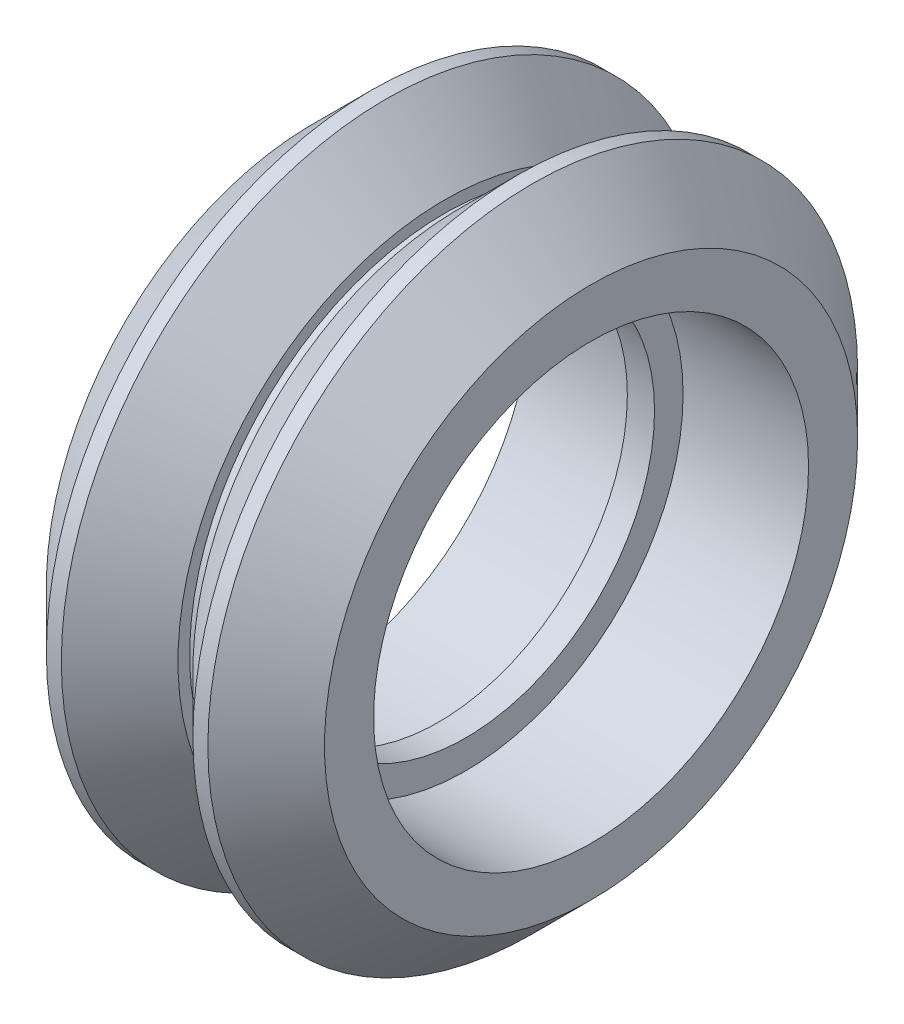
ISO-10303-21;
HEADER;
FILE_DESCRIPTION(('STEP AP214'),'2;1');
FILE_NAME('part.step','',(''),(''),'','','');
FILE_SCHEMA(('AUTOMOTIVE_DESIGN { 1 0 10303 214 1 1 1 1 }'));
ENDSEC;
DATA;
#1=APPLICATION_CONTEXT('core data for automotive mechanical design processes');
#2=APPLICATION_PROTOCOL_DEFINITION('international standard','automotive_design',2000,#1);
#3=PRODUCT_CONTEXT('',#1,'mechanical');
#4=PRODUCT('Part','Part','',(#3));
#5=PRODUCT_RELATED_PRODUCT_CATEGORY('part','',(#4));
#6=PRODUCT_DEFINITION_FORMATION('','',#4);
#7=PRODUCT_DEFINITION_CONTEXT('part definition',#1,'design');
#8=PRODUCT_DEFINITION('design','',#6,#7);
#9=PRODUCT_DEFINITION_SHAPE('','',#8);
#10=(LENGTH_UNIT() NAMED_UNIT(*) SI_UNIT(.MILLI.,.METRE.));
#11=(NAMED_UNIT(*) PLANE_ANGLE_UNIT() SI_UNIT($,.RADIAN.));
#12=(NAMED_UNIT(*) SI_UNIT($,.STERADIAN.) SOLID_ANGLE_UNIT());
#13=UNCERTAINTY_MEASURE_WITH_UNIT(LENGTH_MEASURE(1.E-05),#10,'distance_accuracy_value','');
#14=(GEOMETRIC_REPRESENTATION_CONTEXT(3) GLOBAL_UNCERTAINTY_ASSIGNED_CONTEXT((#13)) GLOBAL_UNIT_ASSIGNED_CONTEXT((#10,
#11,#12)) REPRESENTATION_CONTEXT('',''));
#15=CARTESIAN_POINT('',(0.,0.,0.));
#16=DIRECTION('',(0.,0.,1.));
#17=DIRECTION('',(1.,0.,0.));
#18=AXIS2_PLACEMENT_3D('',#15,#16,#17);
#19=CARTESIAN_POINT('',(-0.499999999999999,6.95,0.));
#20=DIRECTION('',(-1.,0.,0.));
#21=DIRECTION('',(0.,0.,1.));
#22=AXIS2_PLACEMENT_3D('',#19,#20,#21);
#23=PLANE('',#22);
#24=CARTESIAN_POINT('',(-0.499999999999999,0.,0.));
#25=DIRECTION('',(1.,0.,0.));
#26=DIRECTION('',(0.,0.,-1.));
#27=AXIS2_PLACEMENT_3D('',#24,#25,#26);
#28=CIRCLE('',#27,6.95);
#29=CARTESIAN_POINT('',(-0.499999999999999,0.,-6.95));
#30=VERTEX_POINT('',#29);
#31=EDGE_CURVE('E12',#30,#30,#28,.T.);
#32=ORIENTED_EDGE('',*,*,#31,.T.);
#33=EDGE_LOOP('',(#32));
#34=FACE_BOUND('',#33,.T.);
#35=CARTESIAN_POINT('',(-0.499999999999999,0.,0.));
#36=DIRECTION('',(1.,0.,0.));
#37=DIRECTION('',(0.,0.,-1.));
#38=AXIS2_PLACEMENT_3D('',#35,#36,#37);
#39=CIRCLE('',#38,8.);
#40=CARTESIAN_POINT('',(-0.499999999999999,0.,-8.));
#41=VERTEX_POINT('',#40);
#42=EDGE_CURVE('E94',#41,#41,#39,.T.);
#43=ORIENTED_EDGE('',*,*,#42,.F.);
#44=EDGE_LOOP('',(#43));
#45=FACE_BOUND('',#44,.T.);
#46=ADVANCED_FACE('F42',(#34,#45),#23,.T.);
#47=CARTESIAN_POINT('',(0.,0.,0.));
#48=DIRECTION('',(1.,0.,0.));
#49=DIRECTION('',(0.,0.,-1.));
#50=AXIS2_PLACEMENT_3D('',#47,#48,#49);
#51=CYLINDRICAL_SURFACE('',#50,6.95);
#52=CARTESIAN_POINT('',(0.500000000000001,0.,0.));
#53=DIRECTION('',(1.,0.,0.));
#54=DIRECTION('',(0.,0.,-1.));
#55=AXIS2_PLACEMENT_3D('',#52,#53,#54);
#56=CIRCLE('',#55,6.95);
#57=CARTESIAN_POINT('',(0.500000000000001,0.,-6.95));
#58=VERTEX_POINT('',#57);
#59=EDGE_CURVE('E48',#58,#58,#56,.T.);
#60=ORIENTED_EDGE('',*,*,#59,.T.);
#61=EDGE_LOOP('',(#60));
#62=FACE_BOUND('',#61,.T.);
#63=ORIENTED_EDGE('',*,*,#31,.F.);
#64=EDGE_LOOP('',(#63));
#65=FACE_BOUND('',#64,.T.);
#66=ADVANCED_FACE('F102',(#62,#65),#51,.F.);
#67=CARTESIAN_POINT('',(0.500000000000001,6.95,0.));
#68=DIRECTION('',(1.,0.,0.));
#69=DIRECTION('',(0.,0.,-1.));
#70=AXIS2_PLACEMENT_3D('',#67,#68,#69);
#71=PLANE('',#70);
#72=CARTESIAN_POINT('',(0.5,0.,0.));
#73=DIRECTION('',(1.,0.,0.));
#74=DIRECTION('',(0.,0.,-1.));
#75=AXIS2_PLACEMENT_3D('',#72,#73,#74);
#76=CIRCLE('',#75,8.);
#77=CARTESIAN_POINT('',(0.5,0.,-8.));
#78=VERTEX_POINT('',#77);
#79=EDGE_CURVE('E52',#78,#78,#76,.T.);
#80=ORIENTED_EDGE('',*,*,#79,.T.);
#81=EDGE_LOOP('',(#80));
#82=FACE_BOUND('',#81,.T.);
#83=ORIENTED_EDGE('',*,*,#59,.F.);
#84=EDGE_LOOP('',(#83));
#85=FACE_BOUND('',#84,.T.);
#86=ADVANCED_FACE('F106',(#82,#85),#71,.T.);
#87=CARTESIAN_POINT('',(0.,0.,0.));
#88=DIRECTION('',(1.,0.,0.));
#89=DIRECTION('',(0.,0.,-1.));
#90=AXIS2_PLACEMENT_3D('',#87,#88,#89);
#91=CYLINDRICAL_SURFACE('',#90,8.);
#92=CARTESIAN_POINT('',(5.115,0.,0.));
#93=DIRECTION('',(1.,0.,0.));
#94=DIRECTION('',(0.,0.,-1.));
#95=AXIS2_PLACEMENT_3D('',#92,#93,#94);
#96=CIRCLE('',#95,8.);
#97=CARTESIAN_POINT('',(5.115,0.,-8.));
#98=VERTEX_POINT('',#97);
#99=EDGE_CURVE('E56',#98,#98,#96,.T.);
#100=ORIENTED_EDGE('',*,*,#99,.T.);
#101=EDGE_LOOP('',(#100));
#102=FACE_BOUND('',#101,.T.);
#103=ORIENTED_EDGE('',*,*,#79,.F.);
#104=EDGE_LOOP('',(#103));
#105=FACE_BOUND('',#104,.T.);
#106=ADVANCED_FACE('F110',(#102,#105),#91,.F.);
#107=CARTESIAN_POINT('',(5.115,8.,0.));
#108=DIRECTION('',(1.,0.,0.));
#109=DIRECTION('',(0.,0.,-1.));
#110=AXIS2_PLACEMENT_3D('',#107,#108,#109);
#111=PLANE('',#110);
#112=CARTESIAN_POINT('',(5.115,0.,0.));
#113=DIRECTION('',(1.,0.,0.));
#114=DIRECTION('',(0.,0.,-1.));
#115=AXIS2_PLACEMENT_3D('',#112,#113,#114);
#116=CIRCLE('',#115,9.805);
#117=CARTESIAN_POINT('',(5.115,0.,-9.805));
#118=VERTEX_POINT('',#117);
#119=EDGE_CURVE('E61',#118,#118,#116,.T.);
#120=ORIENTED_EDGE('',*,*,#119,.T.);
#121=EDGE_LOOP('',(#120));
#122=FACE_BOUND('',#121,.T.);
#123=ORIENTED_EDGE('',*,*,#99,.F.);
#124=EDGE_LOOP('',(#123));
#125=FACE_BOUND('',#124,.T.);
#126=ADVANCED_FACE('F117',(#122,#125),#111,.T.);
#127=CARTESIAN_POINT('',(5.115,0.,0.));
#128=DIRECTION('',(-1.,0.,0.));
#129=DIRECTION('',(0.,0.,1.));
#130=AXIS2_PLACEMENT_3D('',#127,#128,#129);
#131=CONICAL_SURFACE('',#130,9.805,0.785398163397447);
#132=CARTESIAN_POINT('',(2.96999999999999,0.,0.));
#133=DIRECTION('',(1.,0.,0.));
#134=DIRECTION('',(0.,0.,-1.));
#135=AXIS2_PLACEMENT_3D('',#132,#133,#134);
#136=CIRCLE('',#135,11.95);
#137=CARTESIAN_POINT('',(2.96999999999999,0.,-11.95));
#138=VERTEX_POINT('',#137);
#139=EDGE_CURVE('E64',#138,#138,#136,.T.);
#140=ORIENTED_EDGE('',*,*,#139,.T.);
#141=EDGE_LOOP('',(#140));
#142=FACE_BOUND('',#141,.T.);
#143=ORIENTED_EDGE('',*,*,#119,.F.);
#144=EDGE_LOOP('',(#143));
#145=FACE_BOUND('',#144,.T.);
#146=ADVANCED_FACE('F121',(#142,#145),#131,.T.);
#147=CARTESIAN_POINT('',(0.,0.,0.));
#148=DIRECTION('',(1.,0.,0.));
#149=DIRECTION('',(0.,0.,-1.));
#150=AXIS2_PLACEMENT_3D('',#147,#148,#149);
#151=CYLINDRICAL_SURFACE('',#150,11.95);
#152=CARTESIAN_POINT('',(2.41999999999999,0.,0.));
#153=DIRECTION('',(1.,0.,0.));
#154=DIRECTION('',(0.,0.,-1.));
#155=AXIS2_PLACEMENT_3D('',#152,#153,#154);
#156=CIRCLE('',#155,11.95);
#157=CARTESIAN_POINT('',(2.41999999999999,0.,-11.95));
#158=VERTEX_POINT('',#157);
#159=EDGE_CURVE('E67',#158,#158,#156,.T.);
#160=ORIENTED_EDGE('',*,*,#159,.T.);
#161=EDGE_LOOP('',(#160));
#162=FACE_BOUND('',#161,.T.);
#163=ORIENTED_EDGE('',*,*,#139,.F.);
#164=EDGE_LOOP('',(#163));
#165=FACE_BOUND('',#164,.T.);
#166=ADVANCED_FACE('F125',(#162,#165),#151,.T.);
#167=CARTESIAN_POINT('',(2.41999999999999,0.,0.));
#168=DIRECTION('',(1.,0.,0.));
#169=DIRECTION('',(0.,0.,-1.));
#170=AXIS2_PLACEMENT_3D('',#167,#168,#169);
#171=CONICAL_SURFACE('',#170,11.95,0.785398163397449);
#172=CARTESIAN_POINT('',(0.274999999999998,0.,0.));
#173=DIRECTION('',(1.,0.,0.));
#174=DIRECTION('',(0.,0.,-1.));
#175=AXIS2_PLACEMENT_3D('',#172,#173,#174);
#176=CIRCLE('',#175,9.805);
#177=CARTESIAN_POINT('',(0.274999999999998,0.,-9.805));
#178=VERTEX_POINT('',#177);
#179=EDGE_CURVE('E70',#178,#178,#176,.T.);
#180=ORIENTED_EDGE('',*,*,#179,.T.);
#181=EDGE_LOOP('',(#180));
#182=FACE_BOUND('',#181,.T.);
#183=ORIENTED_EDGE('',*,*,#159,.F.);
#184=EDGE_LOOP('',(#183));
#185=FACE_BOUND('',#184,.T.);
#186=ADVANCED_FACE('F129',(#182,#185),#171,.T.);
#187=CARTESIAN_POINT('',(0.275,9.805,0.));
#188=DIRECTION('',(-1.,0.,0.));
#189=DIRECTION('',(0.,0.,1.));
#190=AXIS2_PLACEMENT_3D('',#187,#188,#189);
#191=PLANE('',#190);
#192=CARTESIAN_POINT('',(0.275000000000003,0.,0.));
#193=DIRECTION('',(1.,0.,0.));
#194=DIRECTION('',(0.,0.,-1.));
#195=AXIS2_PLACEMENT_3D('',#192,#193,#194);
#196=CIRCLE('',#195,9.375);
#197=CARTESIAN_POINT('',(0.275000000000003,0.,-9.375));
#198=VERTEX_POINT('',#197);
#199=EDGE_CURVE('E73',#198,#198,#196,.T.);
#200=ORIENTED_EDGE('',*,*,#199,.T.);
#201=EDGE_LOOP('',(#200));
#202=FACE_BOUND('',#201,.T.);
#203=ORIENTED_EDGE('',*,*,#179,.F.);
#204=EDGE_LOOP('',(#203));
#205=FACE_BOUND('',#204,.T.);
#206=ADVANCED_FACE('F133',(#202,#205),#191,.T.);
#207=CARTESIAN_POINT('',(0.,0.,0.));
#208=DIRECTION('',(1.,0.,0.));
#209=DIRECTION('',(0.,0.,-1.));
#210=AXIS2_PLACEMENT_3D('',#207,#208,#209);
#211=CYLINDRICAL_SURFACE('',#210,9.375);
#212=CARTESIAN_POINT('',(-0.274999999999998,0.,0.));
#213=DIRECTION('',(1.,0.,0.));
#214=DIRECTION('',(0.,0.,-1.));
#215=AXIS2_PLACEMENT_3D('',#212,#213,#214);
#216=CIRCLE('',#215,9.375);
#217=CARTESIAN_POINT('',(-0.274999999999998,0.,-9.375));
#218=VERTEX_POINT('',#217);
#219=EDGE_CURVE('E76',#218,#218,#216,.T.);
#220=ORIENTED_EDGE('',*,*,#219,.T.);
#221=EDGE_LOOP('',(#220));
#222=FACE_BOUND('',#221,.T.);
#223=ORIENTED_EDGE('',*,*,#199,.F.);
#224=EDGE_LOOP('',(#223));
#225=FACE_BOUND('',#224,.T.);
#226=ADVANCED_FACE('F137',(#222,#225),#211,.T.);
#227=CARTESIAN_POINT('',(-0.274999999999998,9.805,0.));
#228=DIRECTION('',(1.,0.,0.));
#229=DIRECTION('',(0.,0.,-1.));
#230=AXIS2_PLACEMENT_3D('',#227,#228,#229);
#231=PLANE('',#230);
#232=CARTESIAN_POINT('',(-0.274999999999998,0.,0.));
#233=DIRECTION('',(1.,0.,0.));
#234=DIRECTION('',(0.,0.,-1.));
#235=AXIS2_PLACEMENT_3D('',#232,#233,#234);
#236=CIRCLE('',#235,9.805);
#237=CARTESIAN_POINT('',(-0.274999999999998,0.,-9.805));
#238=VERTEX_POINT('',#237);
#239=EDGE_CURVE('E79',#238,#238,#236,.T.);
#240=ORIENTED_EDGE('',*,*,#239,.T.);
#241=EDGE_LOOP('',(#240));
#242=FACE_BOUND('',#241,.T.);
#243=ORIENTED_EDGE('',*,*,#219,.F.);
#244=EDGE_LOOP('',(#243));
#245=FACE_BOUND('',#244,.T.);
#246=ADVANCED_FACE('F141',(#242,#245),#231,.T.);
#247=CARTESIAN_POINT('',(-0.274999999999998,0.,0.));
#248=DIRECTION('',(-1.,0.,0.));
#249=DIRECTION('',(0.,0.,1.));
#250=AXIS2_PLACEMENT_3D('',#247,#248,#249);
#251=CONICAL_SURFACE('',#250,9.805,0.785398163397449);
#252=CARTESIAN_POINT('',(-2.41999999999999,0.,0.));
#253=DIRECTION('',(1.,0.,0.));
#254=DIRECTION('',(0.,0.,-1.));
#255=AXIS2_PLACEMENT_3D('',#252,#253,#254);
#256=CIRCLE('',#255,11.95);
#257=CARTESIAN_POINT('',(-2.41999999999999,0.,-11.95));
#258=VERTEX_POINT('',#257);
#259=EDGE_CURVE('E82',#258,#258,#256,.T.);
#260=ORIENTED_EDGE('',*,*,#259,.T.);
#261=EDGE_LOOP('',(#260));
#262=FACE_BOUND('',#261,.T.);
#263=ORIENTED_EDGE('',*,*,#239,.F.);
#264=EDGE_LOOP('',(#263));
#265=FACE_BOUND('',#264,.T.);
#266=ADVANCED_FACE('F145',(#262,#265),#251,.T.);
#267=CARTESIAN_POINT('',(0.,0.,0.));
#268=DIRECTION('',(1.,0.,0.));
#269=DIRECTION('',(0.,0.,-1.));
#270=AXIS2_PLACEMENT_3D('',#267,#268,#269);
#271=CYLINDRICAL_SURFACE('',#270,11.95);
#272=CARTESIAN_POINT('',(-2.96999999999999,0.,0.));
#273=DIRECTION('',(1.,0.,0.));
#274=DIRECTION('',(0.,0.,-1.));
#275=AXIS2_PLACEMENT_3D('',#272,#273,#274);
#276=CIRCLE('',#275,11.95);
#277=CARTESIAN_POINT('',(-2.96999999999999,0.,-11.95));
#278=VERTEX_POINT('',#277);
#279=EDGE_CURVE('E85',#278,#278,#276,.T.);
#280=ORIENTED_EDGE('',*,*,#279,.T.);
#281=EDGE_LOOP('',(#280));
#282=FACE_BOUND('',#281,.T.);
#283=ORIENTED_EDGE('',*,*,#259,.F.);
#284=EDGE_LOOP('',(#283));
#285=FACE_BOUND('',#284,.T.);
#286=ADVANCED_FACE('F149',(#282,#285),#271,.T.);
#287=CARTESIAN_POINT('',(-2.96999999999999,0.,0.));
#288=DIRECTION('',(1.,0.,0.));
#289=DIRECTION('',(0.,0.,-1.));
#290=AXIS2_PLACEMENT_3D('',#287,#288,#289);
#291=CONICAL_SURFACE('',#290,11.95,0.785398163397447);
#292=CARTESIAN_POINT('',(-5.115,0.,0.));
#293=DIRECTION('',(1.,0.,0.));
#294=DIRECTION('',(0.,0.,-1.));
#295=AXIS2_PLACEMENT_3D('',#292,#293,#294);
#296=CIRCLE('',#295,9.805);
#297=CARTESIAN_POINT('',(-5.115,0.,-9.805));
#298=VERTEX_POINT('',#297);
#299=EDGE_CURVE('E88',#298,#298,#296,.T.);
#300=ORIENTED_EDGE('',*,*,#299,.T.);
#301=EDGE_LOOP('',(#300));
#302=FACE_BOUND('',#301,.T.);
#303=ORIENTED_EDGE('',*,*,#279,.F.);
#304=EDGE_LOOP('',(#303));
#305=FACE_BOUND('',#304,.T.);
#306=ADVANCED_FACE('F153',(#302,#305),#291,.T.);
#307=CARTESIAN_POINT('',(-5.115,8.,0.));
#308=DIRECTION('',(-1.,0.,0.));
#309=DIRECTION('',(0.,0.,1.));
#310=AXIS2_PLACEMENT_3D('',#307,#308,#309);
#311=PLANE('',#310);
#312=CARTESIAN_POINT('',(-5.115,0.,0.));
#313=DIRECTION('',(1.,0.,0.));
#314=DIRECTION('',(0.,0.,-1.));
#315=AXIS2_PLACEMENT_3D('',#312,#313,#314);
#316=CIRCLE('',#315,8.);
#317=CARTESIAN_POINT('',(-5.115,0.,-8.));
#318=VERTEX_POINT('',#317);
#319=EDGE_CURVE('E91',#318,#318,#316,.T.);
#320=ORIENTED_EDGE('',*,*,#319,.T.);
#321=EDGE_LOOP('',(#320));
#322=FACE_BOUND('',#321,.T.);
#323=ORIENTED_EDGE('',*,*,#299,.F.);
#324=EDGE_LOOP('',(#323));
#325=FACE_BOUND('',#324,.T.);
#326=ADVANCED_FACE('F157',(#322,#325),#311,.T.);
#327=CARTESIAN_POINT('',(0.,0.,0.));
#328=DIRECTION('',(1.,0.,0.));
#329=DIRECTION('',(0.,0.,-1.));
#330=AXIS2_PLACEMENT_3D('',#327,#328,#329);
#331=CYLINDRICAL_SURFACE('',#330,8.);
#332=ORIENTED_EDGE('',*,*,#42,.T.);
#333=EDGE_LOOP('',(#332));
#334=FACE_BOUND('',#333,.T.);
#335=ORIENTED_EDGE('',*,*,#319,.F.);
#336=EDGE_LOOP('',(#335));
#337=FACE_BOUND('',#336,.T.);
#338=ADVANCED_FACE('F98',(#334,#337),#331,.F.);
#339=CLOSED_SHELL('',(#46,#66,#86,#106,#126,#146,#166,#186,#206,#226,#246,#266,#286,#306,#326,#338));
#340=MANIFOLD_SOLID_BREP('B2',#339);
#341=ADVANCED_BREP_SHAPE_REPRESENTATION('',(#18,#340),#14);
#342=SHAPE_DEFINITION_REPRESENTATION(#9,#341);
ENDSEC;
END-ISO-10303-21;
